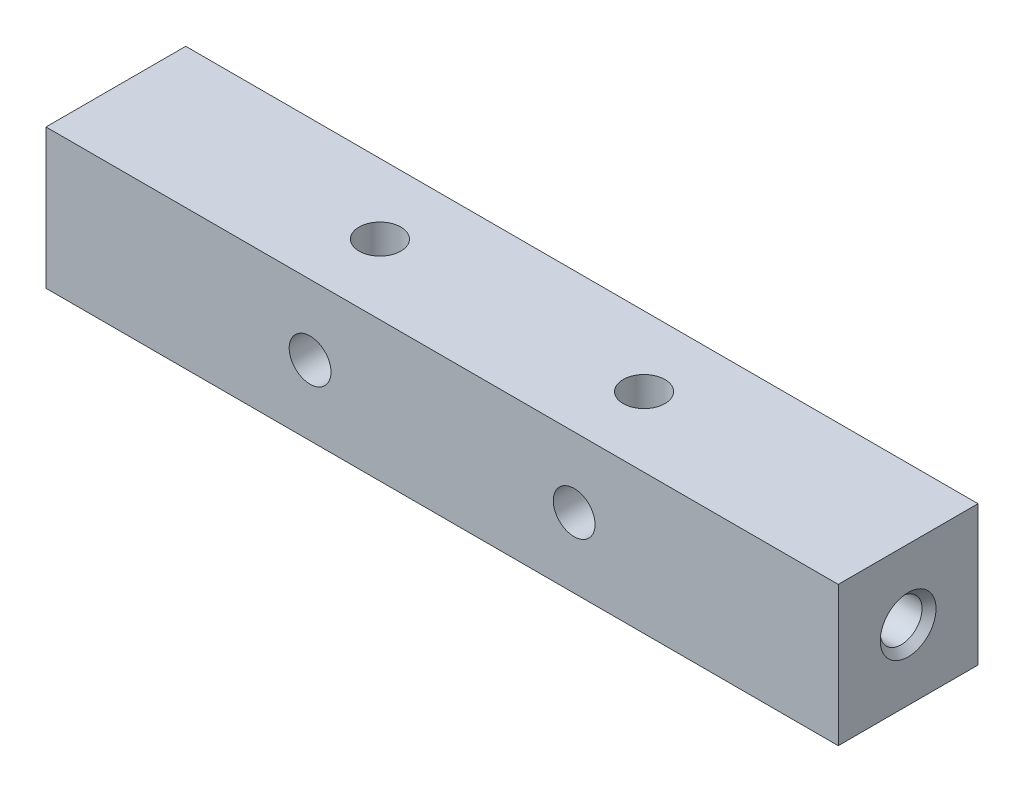
ISO-10303-21;
HEADER;
FILE_DESCRIPTION(('STEP AP214'),'2;1');
FILE_NAME('part.step','',(''),(''),'','','');
FILE_SCHEMA(('AUTOMOTIVE_DESIGN { 1 0 10303 214 1 1 1 1 }'));
ENDSEC;
DATA;
#1=APPLICATION_CONTEXT('core data for automotive mechanical design processes');
#2=APPLICATION_PROTOCOL_DEFINITION('international standard','automotive_design',2000,#1);
#3=PRODUCT_CONTEXT('',#1,'mechanical');
#4=PRODUCT('Part','Part','',(#3));
#5=PRODUCT_RELATED_PRODUCT_CATEGORY('part','',(#4));
#6=PRODUCT_DEFINITION_FORMATION('','',#4);
#7=PRODUCT_DEFINITION_CONTEXT('part definition',#1,'design');
#8=PRODUCT_DEFINITION('design','',#6,#7);
#9=PRODUCT_DEFINITION_SHAPE('','',#8);
#10=(LENGTH_UNIT() NAMED_UNIT(*) SI_UNIT(.MILLI.,.METRE.));
#11=(NAMED_UNIT(*) PLANE_ANGLE_UNIT() SI_UNIT($,.RADIAN.));
#12=(NAMED_UNIT(*) SI_UNIT($,.STERADIAN.) SOLID_ANGLE_UNIT());
#13=UNCERTAINTY_MEASURE_WITH_UNIT(LENGTH_MEASURE(1.E-05),#10,'distance_accuracy_value','');
#14=(GEOMETRIC_REPRESENTATION_CONTEXT(3) GLOBAL_UNCERTAINTY_ASSIGNED_CONTEXT((#13)) GLOBAL_UNIT_ASSIGNED_CONTEXT((#10,
#11,#12)) REPRESENTATION_CONTEXT('',''));
#15=CARTESIAN_POINT('',(0.,0.,0.));
#16=DIRECTION('',(0.,0.,1.));
#17=DIRECTION('',(1.,0.,0.));
#18=AXIS2_PLACEMENT_3D('',#15,#16,#17);
#19=CARTESIAN_POINT('',(48.,0.,6.35));
#20=DIRECTION('',(0.,0.,1.));
#21=DIRECTION('',(1.,0.,0.));
#22=AXIS2_PLACEMENT_3D('',#19,#20,#21);
#23=CYLINDRICAL_SURFACE('',#22,1.89864999999999);
#24=CARTESIAN_POINT('',(48.,0.,6.35));
#25=DIRECTION('',(0.,0.,1.));
#26=DIRECTION('',(1.,0.,0.));
#27=AXIS2_PLACEMENT_3D('',#24,#25,#26);
#28=CIRCLE('',#27,1.89864999999999);
#29=CARTESIAN_POINT('',(49.89865,0.,6.35));
#30=VERTEX_POINT('',#29);
#31=EDGE_CURVE('E217',#30,#30,#28,.T.);
#32=ORIENTED_EDGE('',*,*,#31,.T.);
#33=EDGE_LOOP('',(#32));
#34=FACE_BOUND('',#33,.T.);
#35=CARTESIAN_POINT('',(48.,0.,0.));
#36=DIRECTION('',(0.,-0.707106781186548,0.707106781186547));
#37=DIRECTION('',(0.,0.707106781186547,0.707106781186548));
#38=AXIS2_PLACEMENT_3D('',#35,#36,#37);
#39=ELLIPSE('',#38,2.68509658019966,1.89864999999999);
#40=CARTESIAN_POINT('',(46.10135,0.,0.));
#41=VERTEX_POINT('',#40);
#42=CARTESIAN_POINT('',(49.89865,0.,0.));
#43=VERTEX_POINT('',#42);
#44=EDGE_CURVE('E57',#41,#43,#39,.F.);
#45=ORIENTED_EDGE('',*,*,#44,.T.);
#46=CARTESIAN_POINT('',(48.,0.,0.));
#47=DIRECTION('',(0.,0.707106781186547,0.707106781186548));
#48=DIRECTION('',(0.,-0.707106781186548,0.707106781186547));
#49=AXIS2_PLACEMENT_3D('',#46,#47,#48);
#50=ELLIPSE('',#49,2.68509658019966,1.89864999999999);
#51=EDGE_CURVE('E11',#43,#41,#50,.F.);
#52=ORIENTED_EDGE('',*,*,#51,.T.);
#53=EDGE_LOOP('',(#45,#52));
#54=FACE_BOUND('',#53,.T.);
#55=ADVANCED_FACE('F43',(#34,#54),#23,.F.);
#56=CARTESIAN_POINT('',(24.,0.,6.35));
#57=DIRECTION('',(0.,0.,1.));
#58=DIRECTION('',(1.,0.,0.));
#59=AXIS2_PLACEMENT_3D('',#56,#57,#58);
#60=CYLINDRICAL_SURFACE('',#59,1.89864999999999);
#61=CARTESIAN_POINT('',(24.,0.,6.35));
#62=DIRECTION('',(0.,0.,1.));
#63=DIRECTION('',(1.,0.,0.));
#64=AXIS2_PLACEMENT_3D('',#61,#62,#63);
#65=CIRCLE('',#64,1.89864999999999);
#66=CARTESIAN_POINT('',(25.89865,0.,6.35));
#67=VERTEX_POINT('',#66);
#68=EDGE_CURVE('E177',#67,#67,#65,.T.);
#69=ORIENTED_EDGE('',*,*,#68,.T.);
#70=EDGE_LOOP('',(#69));
#71=FACE_BOUND('',#70,.T.);
#72=CARTESIAN_POINT('',(24.,0.,0.));
#73=DIRECTION('',(0.,-0.707106781186548,0.707106781186547));
#74=DIRECTION('',(0.,0.707106781186547,0.707106781186548));
#75=AXIS2_PLACEMENT_3D('',#72,#73,#74);
#76=ELLIPSE('',#75,2.68509658019967,1.89864999999999);
#77=CARTESIAN_POINT('',(22.10135,0.,0.));
#78=VERTEX_POINT('',#77);
#79=CARTESIAN_POINT('',(25.89865,0.,0.));
#80=VERTEX_POINT('',#79);
#81=EDGE_CURVE('E64',#78,#80,#76,.F.);
#82=ORIENTED_EDGE('',*,*,#81,.T.);
#83=CARTESIAN_POINT('',(24.,0.,0.));
#84=DIRECTION('',(0.,0.707106781186547,0.707106781186548));
#85=DIRECTION('',(0.,-0.707106781186548,0.707106781186547));
#86=AXIS2_PLACEMENT_3D('',#83,#84,#85);
#87=ELLIPSE('',#86,2.68509658019967,1.89864999999999);
#88=EDGE_CURVE('E113',#80,#78,#87,.F.);
#89=ORIENTED_EDGE('',*,*,#88,.T.);
#90=EDGE_LOOP('',(#82,#89));
#91=FACE_BOUND('',#90,.T.);
#92=ADVANCED_FACE('F265',(#71,#91),#60,.F.);
#93=CARTESIAN_POINT('',(72.,-6.35,6.35));
#94=DIRECTION('',(0.,0.,-1.));
#95=DIRECTION('',(-1.,0.,0.));
#96=AXIS2_PLACEMENT_3D('',#93,#94,#95);
#97=PLANE('',#96);
#98=ORIENTED_EDGE('',*,*,#31,.F.);
#99=EDGE_LOOP('',(#98));
#100=FACE_BOUND('',#99,.T.);
#101=ORIENTED_EDGE('',*,*,#68,.F.);
#102=EDGE_LOOP('',(#101));
#103=FACE_BOUND('',#102,.T.);
#104=DIRECTION('',(0.,-1.,0.));
#105=VECTOR('',#104,1.);
#106=CARTESIAN_POINT('',(0.,-6.35,6.35));
#107=LINE('',#106,#105);
#108=CARTESIAN_POINT('',(0.,6.35,6.35));
#109=VERTEX_POINT('',#108);
#110=CARTESIAN_POINT('',(0.,-6.35,6.35));
#111=VERTEX_POINT('',#110);
#112=EDGE_CURVE('E158',#109,#111,#107,.T.);
#113=ORIENTED_EDGE('',*,*,#112,.T.);
#114=DIRECTION('',(-1.,0.,0.));
#115=VECTOR('',#114,1.);
#116=CARTESIAN_POINT('',(72.,-6.35,6.35));
#117=LINE('',#116,#115);
#118=CARTESIAN_POINT('',(72.,-6.35,6.35));
#119=VERTEX_POINT('',#118);
#120=EDGE_CURVE('E131',#119,#111,#117,.T.);
#121=ORIENTED_EDGE('',*,*,#120,.F.);
#122=DIRECTION('',(0.,-1.,0.));
#123=VECTOR('',#122,1.);
#124=CARTESIAN_POINT('',(72.,-6.35,6.35));
#125=LINE('',#124,#123);
#126=CARTESIAN_POINT('',(72.,6.35,6.35));
#127=VERTEX_POINT('',#126);
#128=EDGE_CURVE('E151',#127,#119,#125,.T.);
#129=ORIENTED_EDGE('',*,*,#128,.F.);
#130=DIRECTION('',(-1.,0.,0.));
#131=VECTOR('',#130,1.);
#132=CARTESIAN_POINT('',(72.,6.35,6.35));
#133=LINE('',#132,#131);
#134=EDGE_CURVE('E143',#127,#109,#133,.T.);
#135=ORIENTED_EDGE('',*,*,#134,.T.);
#136=EDGE_LOOP('',(#113,#121,#129,#135));
#137=FACE_BOUND('',#136,.T.);
#138=ADVANCED_FACE('F45',(#100,#103,#137),#97,.F.);
#139=CARTESIAN_POINT('',(72.,-6.35,-6.35));
#140=DIRECTION('',(0.,1.,0.));
#141=DIRECTION('',(0.,0.,1.));
#142=AXIS2_PLACEMENT_3D('',#139,#140,#141);
#143=PLANE('',#142);
#144=CARTESIAN_POINT('',(48.,-6.35,0.));
#145=DIRECTION('',(0.,1.,0.));
#146=DIRECTION('',(0.,0.,1.));
#147=AXIS2_PLACEMENT_3D('',#144,#145,#146);
#148=CIRCLE('',#147,1.89864999999999);
#149=CARTESIAN_POINT('',(48.,-6.35,1.89864999999999));
#150=VERTEX_POINT('',#149);
#151=EDGE_CURVE('E221',#150,#150,#148,.T.);
#152=ORIENTED_EDGE('',*,*,#151,.T.);
#153=EDGE_LOOP('',(#152));
#154=FACE_BOUND('',#153,.T.);
#155=CARTESIAN_POINT('',(24.,-6.35,0.));
#156=DIRECTION('',(0.,1.,0.));
#157=DIRECTION('',(0.,0.,1.));
#158=AXIS2_PLACEMENT_3D('',#155,#156,#157);
#159=CIRCLE('',#158,1.89865);
#160=CARTESIAN_POINT('',(24.,-6.35,1.89865));
#161=VERTEX_POINT('',#160);
#162=EDGE_CURVE('E181',#161,#161,#159,.T.);
#163=ORIENTED_EDGE('',*,*,#162,.T.);
#164=EDGE_LOOP('',(#163));
#165=FACE_BOUND('',#164,.T.);
#166=DIRECTION('',(0.,0.,-1.));
#167=VECTOR('',#166,1.);
#168=CARTESIAN_POINT('',(0.,-6.35,-6.35));
#169=LINE('',#168,#167);
#170=CARTESIAN_POINT('',(0.,-6.35,-6.35));
#171=VERTEX_POINT('',#170);
#172=EDGE_CURVE('E155',#111,#171,#169,.T.);
#173=ORIENTED_EDGE('',*,*,#172,.T.);
#174=DIRECTION('',(-1.,0.,0.));
#175=VECTOR('',#174,1.);
#176=CARTESIAN_POINT('',(72.,-6.35,-6.35));
#177=LINE('',#176,#175);
#178=CARTESIAN_POINT('',(72.,-6.35,-6.35));
#179=VERTEX_POINT('',#178);
#180=EDGE_CURVE('E135',#179,#171,#177,.T.);
#181=ORIENTED_EDGE('',*,*,#180,.F.);
#182=DIRECTION('',(0.,0.,-1.));
#183=VECTOR('',#182,1.);
#184=CARTESIAN_POINT('',(72.,-6.35,-6.35));
#185=LINE('',#184,#183);
#186=EDGE_CURVE('E168',#119,#179,#185,.T.);
#187=ORIENTED_EDGE('',*,*,#186,.F.);
#188=ORIENTED_EDGE('',*,*,#120,.T.);
#189=EDGE_LOOP('',(#173,#181,#187,#188));
#190=FACE_BOUND('',#189,.T.);
#191=ADVANCED_FACE('F252',(#154,#165,#190),#143,.F.);
#192=CARTESIAN_POINT('',(72.,-6.35,-6.35));
#193=DIRECTION('',(0.,0.,1.));
#194=DIRECTION('',(1.,0.,0.));
#195=AXIS2_PLACEMENT_3D('',#192,#193,#194);
#196=PLANE('',#195);
#197=CARTESIAN_POINT('',(48.,0.,-6.35));
#198=DIRECTION('',(0.,0.,1.));
#199=DIRECTION('',(1.,0.,0.));
#200=AXIS2_PLACEMENT_3D('',#197,#198,#199);
#201=CIRCLE('',#200,1.89864999999999);
#202=CARTESIAN_POINT('',(49.89865,0.,-6.35));
#203=VERTEX_POINT('',#202);
#204=EDGE_CURVE('E213',#203,#203,#201,.T.);
#205=ORIENTED_EDGE('',*,*,#204,.T.);
#206=EDGE_LOOP('',(#205));
#207=FACE_BOUND('',#206,.T.);
#208=CARTESIAN_POINT('',(24.,0.,-6.35));
#209=DIRECTION('',(0.,0.,1.));
#210=DIRECTION('',(1.,0.,0.));
#211=AXIS2_PLACEMENT_3D('',#208,#209,#210);
#212=CIRCLE('',#211,1.89865);
#213=CARTESIAN_POINT('',(25.89865,0.,-6.35));
#214=VERTEX_POINT('',#213);
#215=EDGE_CURVE('E162',#214,#214,#212,.T.);
#216=ORIENTED_EDGE('',*,*,#215,.T.);
#217=EDGE_LOOP('',(#216));
#218=FACE_BOUND('',#217,.T.);
#219=DIRECTION('',(0.,1.,0.));
#220=VECTOR('',#219,1.);
#221=CARTESIAN_POINT('',(0.,-6.35,-6.35));
#222=LINE('',#221,#220);
#223=CARTESIAN_POINT('',(0.,6.35,-6.35));
#224=VERTEX_POINT('',#223);
#225=EDGE_CURVE('E152',#171,#224,#222,.T.);
#226=ORIENTED_EDGE('',*,*,#225,.T.);
#227=DIRECTION('',(-1.,0.,0.));
#228=VECTOR('',#227,1.);
#229=CARTESIAN_POINT('',(72.,6.35,-6.35));
#230=LINE('',#229,#228);
#231=CARTESIAN_POINT('',(72.,6.35,-6.35));
#232=VERTEX_POINT('',#231);
#233=EDGE_CURVE('E139',#232,#224,#230,.T.);
#234=ORIENTED_EDGE('',*,*,#233,.F.);
#235=DIRECTION('',(0.,1.,0.));
#236=VECTOR('',#235,1.);
#237=CARTESIAN_POINT('',(72.,-6.35,-6.35));
#238=LINE('',#237,#236);
#239=EDGE_CURVE('E165',#179,#232,#238,.T.);
#240=ORIENTED_EDGE('',*,*,#239,.F.);
#241=ORIENTED_EDGE('',*,*,#180,.T.);
#242=EDGE_LOOP('',(#226,#234,#240,#241));
#243=FACE_BOUND('',#242,.T.);
#244=ADVANCED_FACE('F235',(#207,#218,#243),#196,.F.);
#245=CARTESIAN_POINT('',(72.,6.35,-6.35));
#246=DIRECTION('',(0.,-1.,0.));
#247=DIRECTION('',(0.,0.,-1.));
#248=AXIS2_PLACEMENT_3D('',#245,#246,#247);
#249=PLANE('',#248);
#250=CARTESIAN_POINT('',(48.,6.35,0.));
#251=DIRECTION('',(0.,1.,0.));
#252=DIRECTION('',(0.,0.,1.));
#253=AXIS2_PLACEMENT_3D('',#250,#251,#252);
#254=CIRCLE('',#253,1.89864999999999);
#255=CARTESIAN_POINT('',(48.,6.35,1.89864999999999));
#256=VERTEX_POINT('',#255);
#257=EDGE_CURVE('E225',#256,#256,#254,.T.);
#258=ORIENTED_EDGE('',*,*,#257,.F.);
#259=EDGE_LOOP('',(#258));
#260=FACE_BOUND('',#259,.T.);
#261=CARTESIAN_POINT('',(24.,6.35,0.));
#262=DIRECTION('',(0.,1.,0.));
#263=DIRECTION('',(0.,0.,1.));
#264=AXIS2_PLACEMENT_3D('',#261,#262,#263);
#265=CIRCLE('',#264,1.89864999999999);
#266=CARTESIAN_POINT('',(24.,6.35,1.89864999999999));
#267=VERTEX_POINT('',#266);
#268=EDGE_CURVE('E185',#267,#267,#265,.T.);
#269=ORIENTED_EDGE('',*,*,#268,.F.);
#270=EDGE_LOOP('',(#269));
#271=FACE_BOUND('',#270,.T.);
#272=DIRECTION('',(0.,0.,1.));
#273=VECTOR('',#272,1.);
#274=CARTESIAN_POINT('',(0.,6.35,-6.35));
#275=LINE('',#274,#273);
#276=EDGE_CURVE('E148',#224,#109,#275,.T.);
#277=ORIENTED_EDGE('',*,*,#276,.T.);
#278=ORIENTED_EDGE('',*,*,#134,.F.);
#279=DIRECTION('',(0.,0.,1.));
#280=VECTOR('',#279,1.);
#281=CARTESIAN_POINT('',(72.,6.35,-6.35));
#282=LINE('',#281,#280);
#283=EDGE_CURVE('E147',#232,#127,#282,.T.);
#284=ORIENTED_EDGE('',*,*,#283,.F.);
#285=ORIENTED_EDGE('',*,*,#233,.T.);
#286=EDGE_LOOP('',(#277,#278,#284,#285));
#287=FACE_BOUND('',#286,.T.);
#288=ADVANCED_FACE('F231',(#260,#271,#287),#249,.F.);
#289=CARTESIAN_POINT('',(72.,0.,0.));
#290=DIRECTION('',(1.,0.,0.));
#291=DIRECTION('',(0.,0.,-1.));
#292=AXIS2_PLACEMENT_3D('',#289,#290,#291);
#293=PLANE('',#292);
#294=CARTESIAN_POINT('',(72.,0.,0.));
#295=DIRECTION('',(1.,0.,0.));
#296=DIRECTION('',(0.,0.,-1.));
#297=AXIS2_PLACEMENT_3D('',#294,#295,#296);
#298=CIRCLE('',#297,2.53365);
#299=CARTESIAN_POINT('',(72.,0.,-2.53365));
#300=VERTEX_POINT('',#299);
#301=EDGE_CURVE('E209',#300,#300,#298,.T.);
#302=ORIENTED_EDGE('',*,*,#301,.F.);
#303=EDGE_LOOP('',(#302));
#304=FACE_BOUND('',#303,.T.);
#305=ORIENTED_EDGE('',*,*,#128,.T.);
#306=ORIENTED_EDGE('',*,*,#186,.T.);
#307=ORIENTED_EDGE('',*,*,#239,.T.);
#308=ORIENTED_EDGE('',*,*,#283,.T.);
#309=EDGE_LOOP('',(#305,#306,#307,#308));
#310=FACE_BOUND('',#309,.T.);
#311=ADVANCED_FACE('F234',(#304,#310),#293,.T.);
#312=CARTESIAN_POINT('',(0.,0.,0.));
#313=DIRECTION('',(1.,0.,0.));
#314=DIRECTION('',(0.,0.,-1.));
#315=AXIS2_PLACEMENT_3D('',#312,#313,#314);
#316=PLANE('',#315);
#317=CARTESIAN_POINT('',(0.,0.,0.));
#318=DIRECTION('',(-1.,0.,0.));
#319=DIRECTION('',(0.,0.,1.));
#320=AXIS2_PLACEMENT_3D('',#317,#318,#319);
#321=CIRCLE('',#320,3.025);
#322=CARTESIAN_POINT('',(0.,0.,3.025));
#323=VERTEX_POINT('',#322);
#324=EDGE_CURVE('E197',#323,#323,#321,.T.);
#325=ORIENTED_EDGE('',*,*,#324,.F.);
#326=EDGE_LOOP('',(#325));
#327=FACE_BOUND('',#326,.T.);
#328=ORIENTED_EDGE('',*,*,#112,.F.);
#329=ORIENTED_EDGE('',*,*,#276,.F.);
#330=ORIENTED_EDGE('',*,*,#225,.F.);
#331=ORIENTED_EDGE('',*,*,#172,.F.);
#332=EDGE_LOOP('',(#328,#329,#330,#331));
#333=FACE_BOUND('',#332,.T.);
#334=ADVANCED_FACE('F249',(#327,#333),#316,.F.);
#335=CARTESIAN_POINT('',(24.,0.,0.));
#336=DIRECTION('',(0.,-0.707106781186548,0.707106781186547));
#337=DIRECTION('',(0.,0.707106781186547,0.707106781186548));
#338=AXIS2_PLACEMENT_3D('',#335,#336,#337);
#339=ELLIPSE('',#338,2.68509658019967,1.89864999999999);
#340=EDGE_CURVE('E125',#78,#80,#339,.T.);
#341=ORIENTED_EDGE('',*,*,#340,.T.);
#342=CARTESIAN_POINT('',(24.,0.,0.));
#343=DIRECTION('',(0.,0.707106781186547,0.707106781186548));
#344=DIRECTION('',(0.,-0.707106781186548,0.707106781186547));
#345=AXIS2_PLACEMENT_3D('',#342,#343,#344);
#346=ELLIPSE('',#345,2.68509658019967,1.89864999999999);
#347=EDGE_CURVE('E121',#80,#78,#346,.T.);
#348=ORIENTED_EDGE('',*,*,#347,.T.);
#349=EDGE_LOOP('',(#341,#348));
#350=FACE_BOUND('',#349,.T.);
#351=ORIENTED_EDGE('',*,*,#215,.F.);
#352=EDGE_LOOP('',(#351));
#353=FACE_BOUND('',#352,.T.);
#354=ADVANCED_FACE('F273',(#350,#353),#60,.F.);
#355=CARTESIAN_POINT('',(24.,6.35,0.));
#356=DIRECTION('',(0.,1.,0.));
#357=DIRECTION('',(0.,0.,1.));
#358=AXIS2_PLACEMENT_3D('',#355,#356,#357);
#359=CYLINDRICAL_SURFACE('',#358,1.89864999999999);
#360=ORIENTED_EDGE('',*,*,#268,.T.);
#361=EDGE_LOOP('',(#360));
#362=FACE_BOUND('',#361,.T.);
#363=ORIENTED_EDGE('',*,*,#81,.F.);
#364=ORIENTED_EDGE('',*,*,#347,.F.);
#365=EDGE_LOOP('',(#363,#364));
#366=FACE_BOUND('',#365,.T.);
#367=ADVANCED_FACE('F310',(#362,#366),#359,.F.);
#368=ORIENTED_EDGE('',*,*,#162,.F.);
#369=EDGE_LOOP('',(#368));
#370=FACE_BOUND('',#369,.T.);
#371=ORIENTED_EDGE('',*,*,#340,.F.);
#372=ORIENTED_EDGE('',*,*,#88,.F.);
#373=EDGE_LOOP('',(#371,#372));
#374=FACE_BOUND('',#373,.T.);
#375=ADVANCED_FACE('F307',(#370,#374),#359,.F.);
#376=CARTESIAN_POINT('',(20.32,0.,0.));
#377=DIRECTION('',(-1.,0.,0.));
#378=DIRECTION('',(0.,0.,1.));
#379=AXIS2_PLACEMENT_3D('',#376,#377,#378);
#380=CONICAL_SURFACE('',#379,2.5,1.02974425867665);
#381=CARTESIAN_POINT('',(21.8221515475689,0.,0.));
#382=VERTEX_POINT('',#381);
#383=VERTEX_LOOP('',#382);
#384=FACE_BOUND('',#383,.T.);
#385=CARTESIAN_POINT('',(20.32,0.,0.));
#386=DIRECTION('',(-1.,0.,0.));
#387=DIRECTION('',(0.,0.,1.));
#388=AXIS2_PLACEMENT_3D('',#385,#386,#387);
#389=CIRCLE('',#388,2.5);
#390=CARTESIAN_POINT('',(20.32,0.,2.5));
#391=VERTEX_POINT('',#390);
#392=EDGE_CURVE('E189',#391,#391,#389,.T.);
#393=ORIENTED_EDGE('',*,*,#392,.T.);
#394=EDGE_LOOP('',(#393));
#395=FACE_BOUND('',#394,.T.);
#396=ADVANCED_FACE('F303',(#384,#395),#380,.F.);
#397=CARTESIAN_POINT('',(0.,0.,0.));
#398=DIRECTION('',(-1.,0.,0.));
#399=DIRECTION('',(0.,0.,1.));
#400=AXIS2_PLACEMENT_3D('',#397,#398,#399);
#401=CYLINDRICAL_SURFACE('',#400,2.5);
#402=ORIENTED_EDGE('',*,*,#392,.F.);
#403=EDGE_LOOP('',(#402));
#404=FACE_BOUND('',#403,.T.);
#405=CARTESIAN_POINT('',(0.525000000000001,0.,0.));
#406=DIRECTION('',(-1.,0.,0.));
#407=DIRECTION('',(0.,0.,1.));
#408=AXIS2_PLACEMENT_3D('',#405,#406,#407);
#409=CIRCLE('',#408,2.5);
#410=CARTESIAN_POINT('',(0.525000000000001,0.,2.5));
#411=VERTEX_POINT('',#410);
#412=EDGE_CURVE('E193',#411,#411,#409,.T.);
#413=ORIENTED_EDGE('',*,*,#412,.T.);
#414=EDGE_LOOP('',(#413));
#415=FACE_BOUND('',#414,.T.);
#416=ADVANCED_FACE('F299',(#404,#415),#401,.F.);
#417=CARTESIAN_POINT('',(0.,0.,0.));
#418=DIRECTION('',(-1.,0.,0.));
#419=DIRECTION('',(0.,0.,1.));
#420=AXIS2_PLACEMENT_3D('',#417,#418,#419);
#421=CONICAL_SURFACE('',#420,3.025,0.78539816339745);
#422=ORIENTED_EDGE('',*,*,#412,.F.);
#423=EDGE_LOOP('',(#422));
#424=FACE_BOUND('',#423,.T.);
#425=ORIENTED_EDGE('',*,*,#324,.T.);
#426=EDGE_LOOP('',(#425));
#427=FACE_BOUND('',#426,.T.);
#428=ADVANCED_FACE('F295',(#424,#427),#421,.F.);
#429=CARTESIAN_POINT('',(51.426,0.,0.));
#430=DIRECTION('',(1.,0.,0.));
#431=DIRECTION('',(0.,0.,-1.));
#432=AXIS2_PLACEMENT_3D('',#429,#430,#431);
#433=CONICAL_SURFACE('',#432,1.89864999999999,1.02974425867665);
#434=CARTESIAN_POINT('',(50.2851759856833,0.,0.));
#435=VERTEX_POINT('',#434);
#436=VERTEX_LOOP('',#435);
#437=FACE_BOUND('',#436,.T.);
#438=CARTESIAN_POINT('',(51.426,0.,0.));
#439=DIRECTION('',(1.,0.,0.));
#440=DIRECTION('',(0.,0.,-1.));
#441=AXIS2_PLACEMENT_3D('',#438,#439,#440);
#442=CIRCLE('',#441,1.89864999999999);
#443=CARTESIAN_POINT('',(51.426,0.,-1.89864999999999));
#444=VERTEX_POINT('',#443);
#445=EDGE_CURVE('E201',#444,#444,#442,.T.);
#446=ORIENTED_EDGE('',*,*,#445,.T.);
#447=EDGE_LOOP('',(#446));
#448=FACE_BOUND('',#447,.T.);
#449=ADVANCED_FACE('F287',(#437,#448),#433,.F.);
#450=CARTESIAN_POINT('',(72.,0.,0.));
#451=DIRECTION('',(1.,0.,0.));
#452=DIRECTION('',(0.,0.,-1.));
#453=AXIS2_PLACEMENT_3D('',#450,#451,#452);
#454=CYLINDRICAL_SURFACE('',#453,1.89865);
#455=ORIENTED_EDGE('',*,*,#445,.F.);
#456=EDGE_LOOP('',(#455));
#457=FACE_BOUND('',#456,.T.);
#458=CARTESIAN_POINT('',(71.365,0.,0.));
#459=DIRECTION('',(1.,0.,0.));
#460=DIRECTION('',(0.,0.,-1.));
#461=AXIS2_PLACEMENT_3D('',#458,#459,#460);
#462=CIRCLE('',#461,1.89865);
#463=CARTESIAN_POINT('',(71.365,0.,-1.89865));
#464=VERTEX_POINT('',#463);
#465=EDGE_CURVE('E205',#464,#464,#462,.T.);
#466=ORIENTED_EDGE('',*,*,#465,.T.);
#467=EDGE_LOOP('',(#466));
#468=FACE_BOUND('',#467,.T.);
#469=ADVANCED_FACE('F282',(#457,#468),#454,.F.);
#470=CARTESIAN_POINT('',(72.,0.,0.));
#471=DIRECTION('',(1.,0.,0.));
#472=DIRECTION('',(0.,0.,-1.));
#473=AXIS2_PLACEMENT_3D('',#470,#471,#472);
#474=CONICAL_SURFACE('',#473,2.53365,0.785398163397443);
#475=ORIENTED_EDGE('',*,*,#465,.F.);
#476=EDGE_LOOP('',(#475));
#477=FACE_BOUND('',#476,.T.);
#478=ORIENTED_EDGE('',*,*,#301,.T.);
#479=EDGE_LOOP('',(#478));
#480=FACE_BOUND('',#479,.T.);
#481=ADVANCED_FACE('F277',(#477,#480),#474,.F.);
#482=CARTESIAN_POINT('',(48.,0.,0.));
#483=DIRECTION('',(0.,-0.707106781186548,0.707106781186547));
#484=DIRECTION('',(0.,0.707106781186547,0.707106781186548));
#485=AXIS2_PLACEMENT_3D('',#482,#483,#484);
#486=ELLIPSE('',#485,2.68509658019966,1.89864999999999);
#487=EDGE_CURVE('E104',#41,#43,#486,.T.);
#488=ORIENTED_EDGE('',*,*,#487,.T.);
#489=CARTESIAN_POINT('',(48.,0.,0.));
#490=DIRECTION('',(0.,0.707106781186547,0.707106781186548));
#491=DIRECTION('',(0.,-0.707106781186548,0.707106781186547));
#492=AXIS2_PLACEMENT_3D('',#489,#490,#491);
#493=ELLIPSE('',#492,2.68509658019966,1.89864999999999);
#494=EDGE_CURVE('E52',#43,#41,#493,.T.);
#495=ORIENTED_EDGE('',*,*,#494,.T.);
#496=EDGE_LOOP('',(#488,#495));
#497=FACE_BOUND('',#496,.T.);
#498=ORIENTED_EDGE('',*,*,#204,.F.);
#499=EDGE_LOOP('',(#498));
#500=FACE_BOUND('',#499,.T.);
#501=ADVANCED_FACE('F115',(#497,#500),#23,.F.);
#502=CARTESIAN_POINT('',(48.,6.35,0.));
#503=DIRECTION('',(0.,1.,0.));
#504=DIRECTION('',(0.,0.,1.));
#505=AXIS2_PLACEMENT_3D('',#502,#503,#504);
#506=CYLINDRICAL_SURFACE('',#505,1.89864999999999);
#507=ORIENTED_EDGE('',*,*,#257,.T.);
#508=EDGE_LOOP('',(#507));
#509=FACE_BOUND('',#508,.T.);
#510=ORIENTED_EDGE('',*,*,#44,.F.);
#511=ORIENTED_EDGE('',*,*,#494,.F.);
#512=EDGE_LOOP('',(#510,#511));
#513=FACE_BOUND('',#512,.T.);
#514=ADVANCED_FACE('F111',(#509,#513),#506,.F.);
#515=ORIENTED_EDGE('',*,*,#151,.F.);
#516=EDGE_LOOP('',(#515));
#517=FACE_BOUND('',#516,.T.);
#518=ORIENTED_EDGE('',*,*,#487,.F.);
#519=ORIENTED_EDGE('',*,*,#51,.F.);
#520=EDGE_LOOP('',(#518,#519));
#521=FACE_BOUND('',#520,.T.);
#522=ADVANCED_FACE('F105',(#517,#521),#506,.F.);
#523=CLOSED_SHELL('',(#55,#92,#138,#191,#244,#288,#311,#334,#354,#367,#375,#396,#416,#428,#449,
#469,#481,#501,#514,#522));
#524=MANIFOLD_SOLID_BREP('B2',#523);
#525=ADVANCED_BREP_SHAPE_REPRESENTATION('',(#18,#524),#14);
#526=SHAPE_DEFINITION_REPRESENTATION(#9,#525);
ENDSEC;
END-ISO-10303-21;
